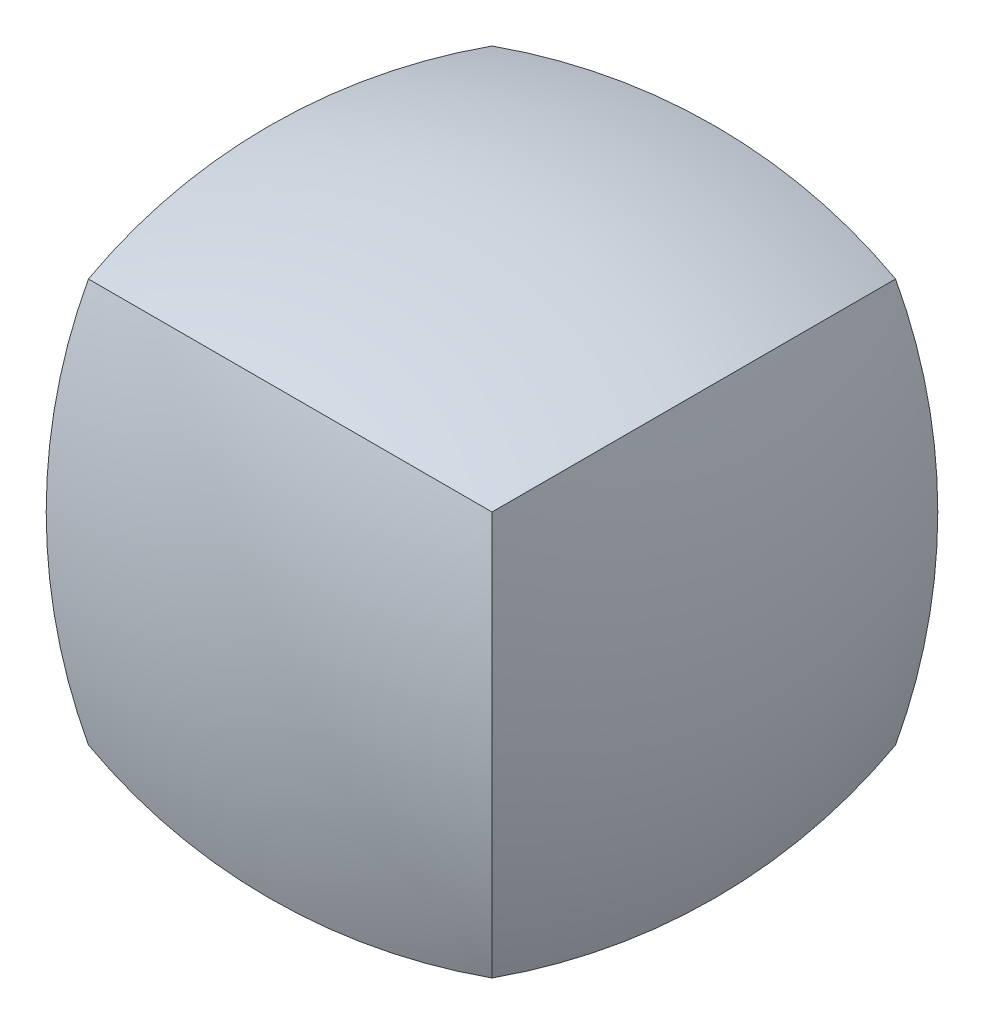
ISO-10303-21;
HEADER;
FILE_DESCRIPTION(('STEP AP214'),'2;1');
FILE_NAME('part.step','',(''),(''),'','','');
FILE_SCHEMA(('AUTOMOTIVE_DESIGN { 1 0 10303 214 1 1 1 1 }'));
ENDSEC;
DATA;
#1=APPLICATION_CONTEXT('core data for automotive mechanical design processes');
#2=APPLICATION_PROTOCOL_DEFINITION('international standard','automotive_design',2000,#1);
#3=PRODUCT_CONTEXT('',#1,'mechanical');
#4=PRODUCT('Part','Part','',(#3));
#5=PRODUCT_RELATED_PRODUCT_CATEGORY('part','',(#4));
#6=PRODUCT_DEFINITION_FORMATION('','',#4);
#7=PRODUCT_DEFINITION_CONTEXT('part definition',#1,'design');
#8=PRODUCT_DEFINITION('design','',#6,#7);
#9=PRODUCT_DEFINITION_SHAPE('','',#8);
#10=(LENGTH_UNIT() NAMED_UNIT(*) SI_UNIT(.MILLI.,.METRE.));
#11=(NAMED_UNIT(*) PLANE_ANGLE_UNIT() SI_UNIT($,.RADIAN.));
#12=(NAMED_UNIT(*) SI_UNIT($,.STERADIAN.) SOLID_ANGLE_UNIT());
#13=UNCERTAINTY_MEASURE_WITH_UNIT(LENGTH_MEASURE(1.E-05),#10,'distance_accuracy_value','');
#14=(GEOMETRIC_REPRESENTATION_CONTEXT(3) GLOBAL_UNCERTAINTY_ASSIGNED_CONTEXT((#13)) GLOBAL_UNIT_ASSIGNED_CONTEXT((#10,
#11,#12)) REPRESENTATION_CONTEXT('',''));
#15=CARTESIAN_POINT('',(0.,0.,0.));
#16=DIRECTION('',(0.,0.,1.));
#17=DIRECTION('',(1.,0.,0.));
#18=AXIS2_PLACEMENT_3D('',#15,#16,#17);
#19=CARTESIAN_POINT('',(0.,33.9612398256182,2.37150207547582E-13));
#20=DIRECTION('',(1.,0.,0.));
#21=DIRECTION('',(0.,-0.953716950748229,0.300705799504267));
#22=AXIS2_PLACEMENT_3D('',#19,#20,#21);
#23=SPHERICAL_SURFACE('',#22,50.);
#24=CARTESIAN_POINT('',(16.9806199128091,16.9806199128092,1.18575103773791E-13));
#25=DIRECTION('',(-0.707106781186549,0.707106781186546,0.));
#26=DIRECTION('',(-0.707106781186546,-0.707106781186549,0.));
#27=AXIS2_PLACEMENT_3D('',#24,#25,#26);
#28=CIRCLE('',#27,43.8556392582918);
#29=CARTESIAN_POINT('',(-12.7010317248436,-12.7010317248435,-12.7010317248437));
#30=VERTEX_POINT('',#29);
#31=CARTESIAN_POINT('',(-12.7010317248436,-12.7010317248437,12.7010317248436));
#32=VERTEX_POINT('',#31);
#33=EDGE_CURVE('E40',#30,#32,#28,.T.);
#34=ORIENTED_EDGE('',*,*,#33,.F.);
#35=CARTESIAN_POINT('',(0.,16.9806199128089,16.9806199128092));
#36=DIRECTION('',(0.,0.707106781186554,-0.707106781186541));
#37=DIRECTION('',(0.,0.707106781186541,0.707106781186554));
#38=AXIS2_PLACEMENT_3D('',#35,#36,#37);
#39=CIRCLE('',#38,43.8556392582918);
#40=CARTESIAN_POINT('',(12.7010317248437,-12.7010317248435,-12.7010317248437));
#41=VERTEX_POINT('',#40);
#42=EDGE_CURVE('E78',#41,#30,#39,.T.);
#43=ORIENTED_EDGE('',*,*,#42,.F.);
#44=CARTESIAN_POINT('',(-16.9806199128091,16.9806199128089,1.18575103773791E-13));
#45=DIRECTION('',(0.707106781186544,0.707106781186551,0.));
#46=DIRECTION('',(-0.707106781186551,0.707106781186544,0.));
#47=AXIS2_PLACEMENT_3D('',#44,#45,#46);
#48=CIRCLE('',#47,43.8556392582917);
#49=CARTESIAN_POINT('',(12.7010317248437,-12.7010317248437,12.7010317248435));
#50=VERTEX_POINT('',#49);
#51=EDGE_CURVE('E72',#50,#41,#48,.T.);
#52=ORIENTED_EDGE('',*,*,#51,.F.);
#53=CARTESIAN_POINT('',(0.,16.9806199128091,-16.980619912809));
#54=DIRECTION('',(0.,0.707106781186544,0.707106781186551));
#55=DIRECTION('',(0.,-0.707106781186551,0.707106781186544));
#56=AXIS2_PLACEMENT_3D('',#53,#54,#55);
#57=CIRCLE('',#56,43.8556392582918);
#58=EDGE_CURVE('E81',#32,#50,#57,.T.);
#59=ORIENTED_EDGE('',*,*,#58,.F.);
#60=EDGE_LOOP('',(#34,#43,#52,#59));
#61=FACE_BOUND('',#60,.T.);
#62=ADVANCED_FACE('F37',(#61),#23,.T.);
#63=CARTESIAN_POINT('',(33.9612398256182,1.23779274201722E-13,0.));
#64=DIRECTION('',(0.,1.,0.));
#65=DIRECTION('',(-0.953716950748227,0.,-0.300705799504274));
#66=AXIS2_PLACEMENT_3D('',#63,#64,#65);
#67=SPHERICAL_SURFACE('',#66,50.);
#68=ORIENTED_EDGE('',*,*,#33,.T.);
#69=CARTESIAN_POINT('',(16.9806199128091,1.21177188987756E-13,-16.9806199128091));
#70=DIRECTION('',(0.707106781186547,0.,0.707106781186547));
#71=DIRECTION('',(0.707106781186548,0.,-0.707106781186547));
#72=AXIS2_PLACEMENT_3D('',#69,#70,#71);
#73=CIRCLE('',#72,43.8556392582918);
#74=CARTESIAN_POINT('',(-12.7010317248436,12.7010317248436,12.7010317248436));
#75=VERTEX_POINT('',#74);
#76=EDGE_CURVE('E95',#75,#32,#73,.T.);
#77=ORIENTED_EDGE('',*,*,#76,.F.);
#78=CARTESIAN_POINT('',(16.9806199128091,-16.980619912809,0.));
#79=DIRECTION('',(0.707106781186546,0.707106781186549,0.));
#80=DIRECTION('',(-0.707106781186549,0.707106781186546,0.));
#81=AXIS2_PLACEMENT_3D('',#78,#79,#80);
#82=CIRCLE('',#81,43.8556392582918);
#83=CARTESIAN_POINT('',(-12.7010317248437,12.7010317248436,-12.7010317248435));
#84=VERTEX_POINT('',#83);
#85=EDGE_CURVE('E54',#84,#75,#82,.T.);
#86=ORIENTED_EDGE('',*,*,#85,.F.);
#87=CARTESIAN_POINT('',(16.9806199128091,-1.15973018559826E-13,16.9806199128091));
#88=DIRECTION('',(0.707106781186547,0.,-0.707106781186547));
#89=DIRECTION('',(-0.707106781186548,0.,-0.707106781186547));
#90=AXIS2_PLACEMENT_3D('',#87,#88,#89);
#91=CIRCLE('',#90,43.8556392582918);
#92=EDGE_CURVE('E85',#30,#84,#91,.T.);
#93=ORIENTED_EDGE('',*,*,#92,.F.);
#94=EDGE_LOOP('',(#68,#77,#86,#93));
#95=FACE_BOUND('',#94,.T.);
#96=ADVANCED_FACE('F91',(#95),#67,.T.);
#97=CARTESIAN_POINT('',(0.,-3.55725311321373E-13,33.9612398256182));
#98=DIRECTION('',(1.,0.,0.));
#99=DIRECTION('',(0.,-0.300705799504264,-0.95371695074823));
#100=AXIS2_PLACEMENT_3D('',#97,#98,#99);
#101=SPHERICAL_SURFACE('',#100,50.);
#102=ORIENTED_EDGE('',*,*,#92,.T.);
#103=CARTESIAN_POINT('',(0.,-16.9806199128093,16.9806199128091));
#104=DIRECTION('',(0.,0.707106781186544,0.707106781186551));
#105=DIRECTION('',(0.,-0.707106781186551,0.707106781186544));
#106=AXIS2_PLACEMENT_3D('',#103,#104,#105);
#107=CIRCLE('',#106,43.8556392582919);
#108=CARTESIAN_POINT('',(12.7010317248435,12.7010317248436,-12.7010317248435));
#109=VERTEX_POINT('',#108);
#110=EDGE_CURVE('E103',#109,#84,#107,.T.);
#111=ORIENTED_EDGE('',*,*,#110,.F.);
#112=CARTESIAN_POINT('',(-16.9806199128091,-3.58327396535339E-13,16.9806199128091));
#113=DIRECTION('',(0.707106781186548,0.,0.707106781186547));
#114=DIRECTION('',(0.707106781186547,0.,-0.707106781186548));
#115=AXIS2_PLACEMENT_3D('',#112,#113,#114);
#116=CIRCLE('',#115,43.8556392582918);
#117=EDGE_CURVE('E90',#41,#109,#116,.T.);
#118=ORIENTED_EDGE('',*,*,#117,.F.);
#119=ORIENTED_EDGE('',*,*,#42,.T.);
#120=EDGE_LOOP('',(#102,#111,#118,#119));
#121=FACE_BOUND('',#120,.T.);
#122=ADVANCED_FACE('F88',(#121),#101,.T.);
#123=CARTESIAN_POINT('',(-33.9612398256182,-3.60929481749304E-13,0.));
#124=DIRECTION('',(0.,-1.,0.));
#125=DIRECTION('',(0.953716950748227,0.,-0.300705799504274));
#126=AXIS2_PLACEMENT_3D('',#123,#124,#125);
#127=SPHERICAL_SURFACE('',#126,50.);
#128=ORIENTED_EDGE('',*,*,#51,.T.);
#129=ORIENTED_EDGE('',*,*,#117,.T.);
#130=CARTESIAN_POINT('',(-16.9806199128091,-16.9806199128093,0.));
#131=DIRECTION('',(-0.707106781186551,0.707106781186544,0.));
#132=DIRECTION('',(-0.707106781186544,-0.707106781186551,0.));
#133=AXIS2_PLACEMENT_3D('',#130,#131,#132);
#134=CIRCLE('',#133,43.8556392582919);
#135=CARTESIAN_POINT('',(12.7010317248435,12.7010317248436,12.7010317248437));
#136=VERTEX_POINT('',#135);
#137=EDGE_CURVE('E46',#136,#109,#134,.T.);
#138=ORIENTED_EDGE('',*,*,#137,.F.);
#139=CARTESIAN_POINT('',(-16.9806199128091,-1.21177188987756E-13,-16.9806199128091));
#140=DIRECTION('',(-0.707106781186548,0.,0.707106781186547));
#141=DIRECTION('',(0.707106781186547,0.,0.707106781186548));
#142=AXIS2_PLACEMENT_3D('',#139,#140,#141);
#143=CIRCLE('',#142,43.8556392582918);
#144=EDGE_CURVE('E98',#50,#136,#143,.T.);
#145=ORIENTED_EDGE('',*,*,#144,.F.);
#146=EDGE_LOOP('',(#128,#129,#138,#145));
#147=FACE_BOUND('',#146,.T.);
#148=ADVANCED_FACE('F108',(#147),#127,.T.);
#149=CARTESIAN_POINT('',(0.,1.18575103773791E-13,-33.9612398256182));
#150=DIRECTION('',(1.,0.,0.));
#151=DIRECTION('',(0.,0.30070579950427,0.953716950748228));
#152=AXIS2_PLACEMENT_3D('',#149,#150,#151);
#153=SPHERICAL_SURFACE('',#152,50.);
#154=ORIENTED_EDGE('',*,*,#76,.T.);
#155=ORIENTED_EDGE('',*,*,#58,.T.);
#156=ORIENTED_EDGE('',*,*,#144,.T.);
#157=CARTESIAN_POINT('',(0.,-16.980619912809,-16.9806199128091));
#158=DIRECTION('',(0.,0.707106781186549,-0.707106781186546));
#159=DIRECTION('',(0.,0.707106781186546,0.707106781186549));
#160=AXIS2_PLACEMENT_3D('',#157,#158,#159);
#161=CIRCLE('',#160,43.8556392582918);
#162=EDGE_CURVE('E11',#75,#136,#161,.T.);
#163=ORIENTED_EDGE('',*,*,#162,.F.);
#164=EDGE_LOOP('',(#154,#155,#156,#163));
#165=FACE_BOUND('',#164,.T.);
#166=ADVANCED_FACE('F111',(#165),#153,.T.);
#167=CARTESIAN_POINT('',(0.,-33.9612398256182,0.));
#168=DIRECTION('',(1.,0.,0.));
#169=DIRECTION('',(0.,0.953716950748227,-0.300705799504274));
#170=AXIS2_PLACEMENT_3D('',#167,#168,#169);
#171=SPHERICAL_SURFACE('',#170,50.);
#172=ORIENTED_EDGE('',*,*,#85,.T.);
#173=ORIENTED_EDGE('',*,*,#162,.T.);
#174=ORIENTED_EDGE('',*,*,#137,.T.);
#175=ORIENTED_EDGE('',*,*,#110,.T.);
#176=EDGE_LOOP('',(#172,#173,#174,#175));
#177=FACE_BOUND('',#176,.T.);
#178=ADVANCED_FACE('F105',(#177),#171,.T.);
#179=CLOSED_SHELL('',(#62,#96,#122,#148,#166,#178));
#180=MANIFOLD_SOLID_BREP('B2',#179);
#181=ADVANCED_BREP_SHAPE_REPRESENTATION('',(#18,#180),#14);
#182=SHAPE_DEFINITION_REPRESENTATION(#9,#181);
ENDSEC;
END-ISO-10303-21;
